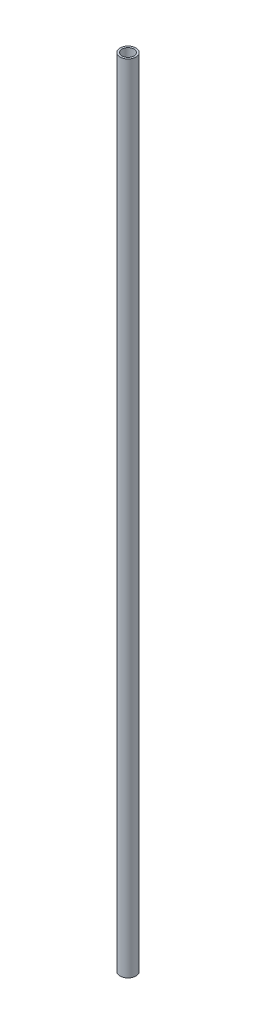
ISO-10303-21;
HEADER;
FILE_DESCRIPTION(('STEP AP214'),'2;1');
FILE_NAME('part.step','',(''),(''),'','','');
FILE_SCHEMA(('AUTOMOTIVE_DESIGN { 1 0 10303 214 1 1 1 1 }'));
ENDSEC;
DATA;
#1=APPLICATION_CONTEXT('core data for automotive mechanical design processes');
#2=APPLICATION_PROTOCOL_DEFINITION('international standard','automotive_design',2000,#1);
#3=PRODUCT_CONTEXT('',#1,'mechanical');
#4=PRODUCT('Part','Part','',(#3));
#5=PRODUCT_RELATED_PRODUCT_CATEGORY('part','',(#4));
#6=PRODUCT_DEFINITION_FORMATION('','',#4);
#7=PRODUCT_DEFINITION_CONTEXT('part definition',#1,'design');
#8=PRODUCT_DEFINITION('design','',#6,#7);
#9=PRODUCT_DEFINITION_SHAPE('','',#8);
#10=(LENGTH_UNIT() NAMED_UNIT(*) SI_UNIT(.MILLI.,.METRE.));
#11=(NAMED_UNIT(*) PLANE_ANGLE_UNIT() SI_UNIT($,.RADIAN.));
#12=(NAMED_UNIT(*) SI_UNIT($,.STERADIAN.) SOLID_ANGLE_UNIT());
#13=UNCERTAINTY_MEASURE_WITH_UNIT(LENGTH_MEASURE(1.E-05),#10,'distance_accuracy_value','');
#14=(GEOMETRIC_REPRESENTATION_CONTEXT(3) GLOBAL_UNCERTAINTY_ASSIGNED_CONTEXT((#13)) GLOBAL_UNIT_ASSIGNED_CONTEXT((#10,
#11,#12)) REPRESENTATION_CONTEXT('',''));
#15=CARTESIAN_POINT('',(0.,0.,0.));
#16=DIRECTION('',(0.,0.,1.));
#17=DIRECTION('',(1.,0.,0.));
#18=AXIS2_PLACEMENT_3D('',#15,#16,#17);
#19=CARTESIAN_POINT('',(0.,200.,0.));
#20=DIRECTION('',(0.,1.,0.));
#21=DIRECTION('',(0.,0.,1.));
#22=AXIS2_PLACEMENT_3D('',#19,#20,#21);
#23=PLANE('',#22);
#24=CARTESIAN_POINT('',(0.,200.,0.));
#25=DIRECTION('',(0.,1.,0.));
#26=DIRECTION('',(0.,0.,1.));
#27=AXIS2_PLACEMENT_3D('',#24,#25,#26);
#28=CIRCLE('',#27,2.);
#29=CARTESIAN_POINT('',(0.,200.,2.));
#30=VERTEX_POINT('',#29);
#31=EDGE_CURVE('E10',#30,#30,#28,.T.);
#32=ORIENTED_EDGE('',*,*,#31,.T.);
#33=EDGE_LOOP('',(#32));
#34=FACE_BOUND('',#33,.T.);
#35=CARTESIAN_POINT('',(0.,200.,0.));
#36=DIRECTION('',(0.,1.,0.));
#37=DIRECTION('',(0.,0.,1.));
#38=AXIS2_PLACEMENT_3D('',#35,#36,#37);
#39=CIRCLE('',#38,1.5);
#40=CARTESIAN_POINT('',(0.,200.,1.5));
#41=VERTEX_POINT('',#40);
#42=EDGE_CURVE('E41',#41,#41,#39,.T.);
#43=ORIENTED_EDGE('',*,*,#42,.F.);
#44=EDGE_LOOP('',(#43));
#45=FACE_BOUND('',#44,.T.);
#46=ADVANCED_FACE('F30',(#34,#45),#23,.T.);
#47=CARTESIAN_POINT('',(0.,0.,0.));
#48=DIRECTION('',(0.,1.,0.));
#49=DIRECTION('',(0.,0.,1.));
#50=AXIS2_PLACEMENT_3D('',#47,#48,#49);
#51=PLANE('',#50);
#52=CARTESIAN_POINT('',(0.,0.,0.));
#53=DIRECTION('',(0.,1.,0.));
#54=DIRECTION('',(0.,0.,1.));
#55=AXIS2_PLACEMENT_3D('',#52,#53,#54);
#56=CIRCLE('',#55,2.);
#57=CARTESIAN_POINT('',(0.,0.,2.));
#58=VERTEX_POINT('',#57);
#59=EDGE_CURVE('E34',#58,#58,#56,.T.);
#60=ORIENTED_EDGE('',*,*,#59,.F.);
#61=EDGE_LOOP('',(#60));
#62=FACE_BOUND('',#61,.T.);
#63=CARTESIAN_POINT('',(0.,0.,0.));
#64=DIRECTION('',(0.,1.,0.));
#65=DIRECTION('',(0.,0.,1.));
#66=AXIS2_PLACEMENT_3D('',#63,#64,#65);
#67=CIRCLE('',#66,1.5);
#68=CARTESIAN_POINT('',(0.,0.,1.5));
#69=VERTEX_POINT('',#68);
#70=EDGE_CURVE('E43',#69,#69,#67,.T.);
#71=ORIENTED_EDGE('',*,*,#70,.T.);
#72=EDGE_LOOP('',(#71));
#73=FACE_BOUND('',#72,.T.);
#74=ADVANCED_FACE('F53',(#62,#73),#51,.F.);
#75=CARTESIAN_POINT('',(0.,200.,0.));
#76=DIRECTION('',(0.,-1.,0.));
#77=DIRECTION('',(0.,0.,-1.));
#78=AXIS2_PLACEMENT_3D('',#75,#76,#77);
#79=CYLINDRICAL_SURFACE('',#78,2.);
#80=ORIENTED_EDGE('',*,*,#31,.F.);
#81=EDGE_LOOP('',(#80));
#82=FACE_BOUND('',#81,.T.);
#83=ORIENTED_EDGE('',*,*,#59,.T.);
#84=EDGE_LOOP('',(#83));
#85=FACE_BOUND('',#84,.T.);
#86=ADVANCED_FACE('F32',(#82,#85),#79,.T.);
#87=CARTESIAN_POINT('',(0.,200.,0.));
#88=DIRECTION('',(0.,-1.,0.));
#89=DIRECTION('',(0.,0.,-1.));
#90=AXIS2_PLACEMENT_3D('',#87,#88,#89);
#91=CYLINDRICAL_SURFACE('',#90,1.5);
#92=ORIENTED_EDGE('',*,*,#42,.T.);
#93=EDGE_LOOP('',(#92));
#94=FACE_BOUND('',#93,.T.);
#95=ORIENTED_EDGE('',*,*,#70,.F.);
#96=EDGE_LOOP('',(#95));
#97=FACE_BOUND('',#96,.T.);
#98=ADVANCED_FACE('F49',(#94,#97),#91,.F.);
#99=CLOSED_SHELL('',(#46,#74,#86,#98));
#100=MANIFOLD_SOLID_BREP('B2',#99);
#101=ADVANCED_BREP_SHAPE_REPRESENTATION('',(#18,#100),#14);
#102=SHAPE_DEFINITION_REPRESENTATION(#9,#101);
ENDSEC;
END-ISO-10303-21;
